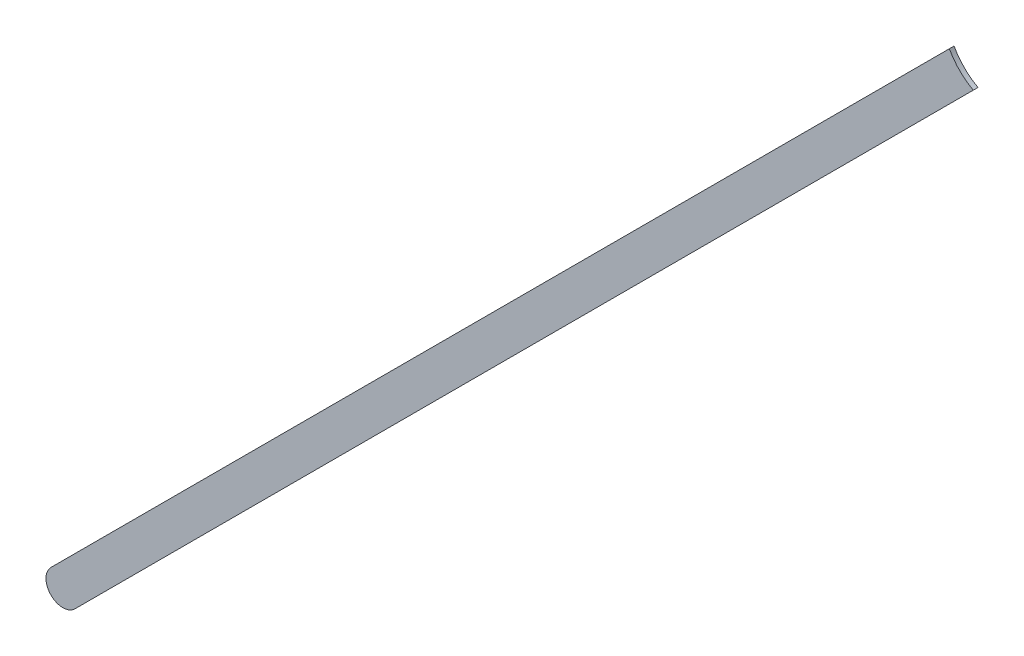
ISO-10303-21;
HEADER;
FILE_DESCRIPTION(('STEP AP214'),'2;1');
FILE_NAME('part.step','',(''),(''),'','','');
FILE_SCHEMA(('AUTOMOTIVE_DESIGN { 1 0 10303 214 1 1 1 1 }'));
ENDSEC;
DATA;
#1=APPLICATION_CONTEXT('core data for automotive mechanical design processes');
#2=APPLICATION_PROTOCOL_DEFINITION('international standard','automotive_design',2000,#1);
#3=PRODUCT_CONTEXT('',#1,'mechanical');
#4=PRODUCT('Part','Part','',(#3));
#5=PRODUCT_RELATED_PRODUCT_CATEGORY('part','',(#4));
#6=PRODUCT_DEFINITION_FORMATION('','',#4);
#7=PRODUCT_DEFINITION_CONTEXT('part definition',#1,'design');
#8=PRODUCT_DEFINITION('design','',#6,#7);
#9=PRODUCT_DEFINITION_SHAPE('','',#8);
#10=(LENGTH_UNIT() NAMED_UNIT(*) SI_UNIT(.MILLI.,.METRE.));
#11=(NAMED_UNIT(*) PLANE_ANGLE_UNIT() SI_UNIT($,.RADIAN.));
#12=(NAMED_UNIT(*) SI_UNIT($,.STERADIAN.) SOLID_ANGLE_UNIT());
#13=UNCERTAINTY_MEASURE_WITH_UNIT(LENGTH_MEASURE(1.E-05),#10,'distance_accuracy_value','');
#14=(GEOMETRIC_REPRESENTATION_CONTEXT(3) GLOBAL_UNCERTAINTY_ASSIGNED_CONTEXT((#13)) GLOBAL_UNIT_ASSIGNED_CONTEXT((#10,
#11,#12)) REPRESENTATION_CONTEXT('',''));
#15=CARTESIAN_POINT('',(0.,0.,0.));
#16=DIRECTION('',(0.,0.,1.));
#17=DIRECTION('',(1.,0.,0.));
#18=AXIS2_PLACEMENT_3D('',#15,#16,#17);
#19=CARTESIAN_POINT('',(76.89977254,80.45015914,0.));
#20=DIRECTION('',(-0.707106781186548,0.707106781186548,0.));
#21=DIRECTION('',(0.707106781186548,0.707106781186548,0.));
#22=AXIS2_PLACEMENT_3D('',#19,#20,#21);
#23=PLANE('',#22);
#24=DIRECTION('',(0.707106781186548,0.707106781186548,0.));
#25=VECTOR('',#24,1.);
#26=CARTESIAN_POINT('',(76.89977254,80.45015914,0.03556));
#27=LINE('',#26,#25);
#28=CARTESIAN_POINT('',(76.89977254,80.45015914,0.03556));
#29=VERTEX_POINT('',#28);
#30=CARTESIAN_POINT('',(83.6415215086503,87.1919081086503,0.03556));
#31=VERTEX_POINT('',#30);
#32=EDGE_CURVE('E11',#29,#31,#27,.T.);
#33=ORIENTED_EDGE('',*,*,#32,.F.);
#34=DIRECTION('',(0.,0.,1.));
#35=VECTOR('',#34,1.);
#36=CARTESIAN_POINT('',(76.89977254,80.45015914,0.));
#37=LINE('',#36,#35);
#38=CARTESIAN_POINT('',(76.89977254,80.45015914,0.));
#39=VERTEX_POINT('',#38);
#40=EDGE_CURVE('E24',#39,#29,#37,.T.);
#41=ORIENTED_EDGE('',*,*,#40,.F.);
#42=DIRECTION('',(0.707106781186548,0.707106781186548,0.));
#43=VECTOR('',#42,1.);
#44=CARTESIAN_POINT('',(76.89977254,80.45015914,0.));
#45=LINE('',#44,#43);
#46=CARTESIAN_POINT('',(83.6415215086503,87.1919081086503,0.));
#47=VERTEX_POINT('',#46);
#48=EDGE_CURVE('E75',#39,#47,#45,.T.);
#49=ORIENTED_EDGE('',*,*,#48,.T.);
#50=DIRECTION('',(0.,0.,1.));
#51=VECTOR('',#50,1.);
#52=CARTESIAN_POINT('',(83.6415215086503,87.1919081086503,0.));
#53=LINE('',#52,#51);
#54=EDGE_CURVE('E37',#47,#31,#53,.T.);
#55=ORIENTED_EDGE('',*,*,#54,.T.);
#56=EDGE_LOOP('',(#33,#41,#49,#55));
#57=FACE_BOUND('',#56,.T.);
#58=ADVANCED_FACE('F17',(#57),#23,.F.);
#59=CARTESIAN_POINT('',(83.8569824,87.5869724,0.));
#60=DIRECTION('',(0.,0.,-1.));
#61=DIRECTION('',(1.,0.,0.));
#62=AXIS2_PLACEMENT_3D('',#59,#60,#61);
#63=CYLINDRICAL_SURFACE('',#62,0.4499991);
#64=DIRECTION('',(0.,0.,1.));
#65=VECTOR('',#64,1.);
#66=CARTESIAN_POINT('',(83.4619181086504,87.3715115086503,0.));
#67=LINE('',#66,#65);
#68=CARTESIAN_POINT('',(83.4619181086504,87.3715115086503,0.));
#69=VERTEX_POINT('',#68);
#70=CARTESIAN_POINT('',(83.4619181086504,87.3715115086503,0.03556));
#71=VERTEX_POINT('',#70);
#72=EDGE_CURVE('E67',#69,#71,#67,.T.);
#73=ORIENTED_EDGE('',*,*,#72,.T.);
#74=CARTESIAN_POINT('',(83.8569824,87.5869724,0.03556));
#75=DIRECTION('',(0.,0.,1.));
#76=DIRECTION('',(1.,0.,0.));
#77=AXIS2_PLACEMENT_3D('',#74,#75,#76);
#78=CIRCLE('',#77,0.4499991);
#79=EDGE_CURVE('E82',#71,#31,#78,.T.);
#80=ORIENTED_EDGE('',*,*,#79,.T.);
#81=ORIENTED_EDGE('',*,*,#54,.F.);
#82=CARTESIAN_POINT('',(83.8569824,87.5869724,0.));
#83=DIRECTION('',(0.,0.,1.));
#84=DIRECTION('',(1.,0.,0.));
#85=AXIS2_PLACEMENT_3D('',#82,#83,#84);
#86=CIRCLE('',#85,0.4499991);
#87=EDGE_CURVE('E80',#69,#47,#86,.T.);
#88=ORIENTED_EDGE('',*,*,#87,.F.);
#89=EDGE_LOOP('',(#73,#80,#81,#88));
#90=FACE_BOUND('',#89,.T.);
#91=ADVANCED_FACE('F88',(#90),#63,.F.);
#92=CARTESIAN_POINT('',(83.4619181086503,87.3715115086503,0.));
#93=DIRECTION('',(0.707106781186547,-0.707106781186548,0.));
#94=DIRECTION('',(-0.707106781186548,-0.707106781186547,0.));
#95=AXIS2_PLACEMENT_3D('',#92,#93,#94);
#96=PLANE('',#95);
#97=DIRECTION('',(-0.707106781186548,-0.707106781186547,0.));
#98=VECTOR('',#97,1.);
#99=CARTESIAN_POINT('',(83.7671807,87.6767741,0.03556));
#100=LINE('',#99,#98);
#101=CARTESIAN_POINT('',(76.72016914,80.62976254,0.03556));
#102=VERTEX_POINT('',#101);
#103=EDGE_CURVE('E71',#71,#102,#100,.T.);
#104=ORIENTED_EDGE('',*,*,#103,.F.);
#105=ORIENTED_EDGE('',*,*,#72,.F.);
#106=DIRECTION('',(-0.707106781186548,-0.707106781186547,0.));
#107=VECTOR('',#106,1.);
#108=CARTESIAN_POINT('',(83.7671807,87.6767741,0.));
#109=LINE('',#108,#107);
#110=CARTESIAN_POINT('',(76.72016914,80.62976254,0.));
#111=VERTEX_POINT('',#110);
#112=EDGE_CURVE('E63',#69,#111,#109,.T.);
#113=ORIENTED_EDGE('',*,*,#112,.T.);
#114=DIRECTION('',(0.,0.,1.));
#115=VECTOR('',#114,1.);
#116=CARTESIAN_POINT('',(76.72016914,80.62976254,0.));
#117=LINE('',#116,#115);
#118=EDGE_CURVE('E53',#111,#102,#117,.T.);
#119=ORIENTED_EDGE('',*,*,#118,.T.);
#120=EDGE_LOOP('',(#104,#105,#113,#119));
#121=FACE_BOUND('',#120,.T.);
#122=ADVANCED_FACE('F66',(#121),#96,.F.);
#123=CARTESIAN_POINT('',(76.80997084,80.53996084,0.));
#124=DIRECTION('',(0.,0.,-1.));
#125=DIRECTION('',(-0.707106781186548,0.707106781186548,0.));
#126=AXIS2_PLACEMENT_3D('',#123,#124,#125);
#127=CYLINDRICAL_SURFACE('',#126,0.126998782064163);
#128=CARTESIAN_POINT('',(76.80997084,80.53996084,0.03556));
#129=DIRECTION('',(0.,0.,1.));
#130=DIRECTION('',(-0.707106781186548,0.707106781186548,0.));
#131=AXIS2_PLACEMENT_3D('',#128,#129,#130);
#132=CIRCLE('',#131,0.126998782064163);
#133=EDGE_CURVE('E59',#102,#29,#132,.T.);
#134=ORIENTED_EDGE('',*,*,#133,.F.);
#135=ORIENTED_EDGE('',*,*,#118,.F.);
#136=CARTESIAN_POINT('',(76.80997084,80.53996084,0.));
#137=DIRECTION('',(0.,0.,1.));
#138=DIRECTION('',(-0.707106781186548,0.707106781186548,0.));
#139=AXIS2_PLACEMENT_3D('',#136,#137,#138);
#140=CIRCLE('',#139,0.126998782064163);
#141=EDGE_CURVE('E57',#111,#39,#140,.T.);
#142=ORIENTED_EDGE('',*,*,#141,.T.);
#143=ORIENTED_EDGE('',*,*,#40,.T.);
#144=EDGE_LOOP('',(#134,#135,#142,#143));
#145=FACE_BOUND('',#144,.T.);
#146=ADVANCED_FACE('F55',(#145),#127,.T.);
#147=CARTESIAN_POINT('',(76.89977254,80.45015914,0.));
#148=DIRECTION('',(0.,0.,-1.));
#149=DIRECTION('',(-1.,0.,0.));
#150=AXIS2_PLACEMENT_3D('',#147,#148,#149);
#151=PLANE('',#150);
#152=ORIENTED_EDGE('',*,*,#48,.F.);
#153=ORIENTED_EDGE('',*,*,#141,.F.);
#154=ORIENTED_EDGE('',*,*,#112,.F.);
#155=ORIENTED_EDGE('',*,*,#87,.T.);
#156=EDGE_LOOP('',(#152,#153,#154,#155));
#157=FACE_BOUND('',#156,.T.);
#158=ADVANCED_FACE('F74',(#157),#151,.T.);
#159=CARTESIAN_POINT('',(76.89977254,80.45015914,0.03556));
#160=DIRECTION('',(0.,0.,-1.));
#161=DIRECTION('',(-1.,0.,0.));
#162=AXIS2_PLACEMENT_3D('',#159,#160,#161);
#163=PLANE('',#162);
#164=ORIENTED_EDGE('',*,*,#133,.T.);
#165=ORIENTED_EDGE('',*,*,#32,.T.);
#166=ORIENTED_EDGE('',*,*,#79,.F.);
#167=ORIENTED_EDGE('',*,*,#103,.T.);
#168=EDGE_LOOP('',(#164,#165,#166,#167));
#169=FACE_BOUND('',#168,.T.);
#170=ADVANCED_FACE('F91',(#169),#163,.F.);
#171=CLOSED_SHELL('',(#58,#91,#122,#146,#158,#170));
#172=MANIFOLD_SOLID_BREP('B1',#171);
#173=ADVANCED_BREP_SHAPE_REPRESENTATION('',(#18,#172),#14);
#174=SHAPE_DEFINITION_REPRESENTATION(#9,#173);
ENDSEC;
END-ISO-10303-21;
